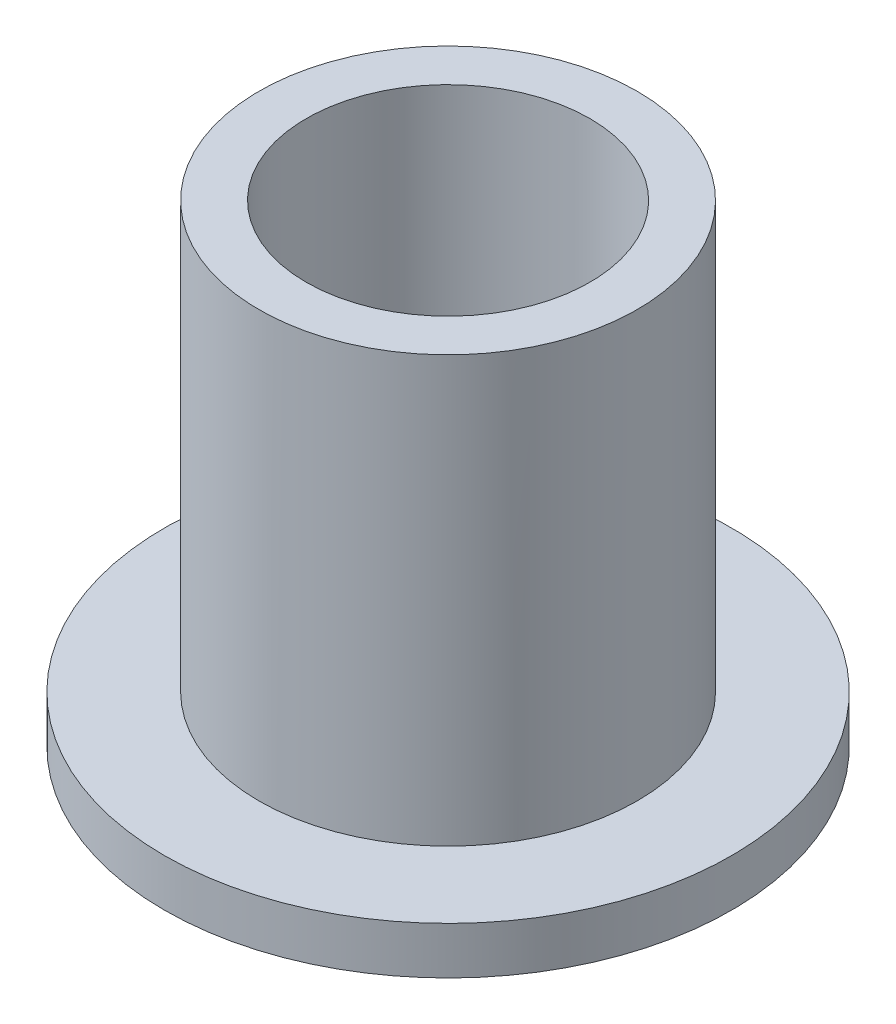
ISO-10303-21;
HEADER;
FILE_DESCRIPTION(('STEP AP214'),'2;1');
FILE_NAME('part.step','',(''),(''),'','','');
FILE_SCHEMA(('AUTOMOTIVE_DESIGN { 1 0 10303 214 1 1 1 1 }'));
ENDSEC;
DATA;
#1=APPLICATION_CONTEXT('core data for automotive mechanical design processes');
#2=APPLICATION_PROTOCOL_DEFINITION('international standard','automotive_design',2000,#1);
#3=PRODUCT_CONTEXT('',#1,'mechanical');
#4=PRODUCT('Part','Part','',(#3));
#5=PRODUCT_RELATED_PRODUCT_CATEGORY('part','',(#4));
#6=PRODUCT_DEFINITION_FORMATION('','',#4);
#7=PRODUCT_DEFINITION_CONTEXT('part definition',#1,'design');
#8=PRODUCT_DEFINITION('design','',#6,#7);
#9=PRODUCT_DEFINITION_SHAPE('','',#8);
#10=(LENGTH_UNIT() NAMED_UNIT(*) SI_UNIT(.MILLI.,.METRE.));
#11=(NAMED_UNIT(*) PLANE_ANGLE_UNIT() SI_UNIT($,.RADIAN.));
#12=(NAMED_UNIT(*) SI_UNIT($,.STERADIAN.) SOLID_ANGLE_UNIT());
#13=UNCERTAINTY_MEASURE_WITH_UNIT(LENGTH_MEASURE(1.E-05),#10,'distance_accuracy_value','');
#14=(GEOMETRIC_REPRESENTATION_CONTEXT(3) GLOBAL_UNCERTAINTY_ASSIGNED_CONTEXT((#13)) GLOBAL_UNIT_ASSIGNED_CONTEXT((#10,
#11,#12)) REPRESENTATION_CONTEXT('',''));
#15=CARTESIAN_POINT('',(0.,0.,0.));
#16=DIRECTION('',(0.,0.,1.));
#17=DIRECTION('',(1.,0.,0.));
#18=AXIS2_PLACEMENT_3D('',#15,#16,#17);
#19=CARTESIAN_POINT('',(0.,10.,-3.));
#20=DIRECTION('',(0.,1.,0.));
#21=DIRECTION('',(0.,0.,1.));
#22=AXIS2_PLACEMENT_3D('',#19,#20,#21);
#23=PLANE('',#22);
#24=CARTESIAN_POINT('',(0.,10.,0.));
#25=DIRECTION('',(0.,-1.,0.));
#26=DIRECTION('',(0.,0.,-1.));
#27=AXIS2_PLACEMENT_3D('',#24,#25,#26);
#28=CIRCLE('',#27,3.);
#29=CARTESIAN_POINT('',(0.,10.,-3.));
#30=VERTEX_POINT('',#29);
#31=EDGE_CURVE('E55',#30,#30,#28,.T.);
#32=ORIENTED_EDGE('',*,*,#31,.T.);
#33=EDGE_LOOP('',(#32));
#34=FACE_BOUND('',#33,.T.);
#35=CARTESIAN_POINT('',(0.,10.,0.));
#36=DIRECTION('',(0.,-1.,0.));
#37=DIRECTION('',(0.,0.,-1.));
#38=AXIS2_PLACEMENT_3D('',#35,#36,#37);
#39=CIRCLE('',#38,4.);
#40=CARTESIAN_POINT('',(0.,10.,-4.));
#41=VERTEX_POINT('',#40);
#42=EDGE_CURVE('E43',#41,#41,#39,.T.);
#43=ORIENTED_EDGE('',*,*,#42,.F.);
#44=EDGE_LOOP('',(#43));
#45=FACE_BOUND('',#44,.T.);
#46=ADVANCED_FACE('F36',(#34,#45),#23,.T.);
#47=CARTESIAN_POINT('',(0.,0.,0.));
#48=DIRECTION('',(0.,-1.,0.));
#49=DIRECTION('',(0.,0.,-1.));
#50=AXIS2_PLACEMENT_3D('',#47,#48,#49);
#51=CYLINDRICAL_SURFACE('',#50,4.);
#52=CARTESIAN_POINT('',(0.,1.,0.));
#53=DIRECTION('',(0.,1.,0.));
#54=DIRECTION('',(0.,0.,1.));
#55=AXIS2_PLACEMENT_3D('',#52,#53,#54);
#56=CIRCLE('',#55,4.);
#57=CARTESIAN_POINT('',(0.,1.,4.));
#58=VERTEX_POINT('',#57);
#59=EDGE_CURVE('E10',#58,#58,#56,.F.);
#60=ORIENTED_EDGE('',*,*,#59,.F.);
#61=EDGE_LOOP('',(#60));
#62=FACE_BOUND('',#61,.T.);
#63=ORIENTED_EDGE('',*,*,#42,.T.);
#64=EDGE_LOOP('',(#63));
#65=FACE_BOUND('',#64,.T.);
#66=ADVANCED_FACE('F79',(#62,#65),#51,.T.);
#67=CARTESIAN_POINT('',(0.,0.,-4.));
#68=DIRECTION('',(0.,-1.,0.));
#69=DIRECTION('',(0.,0.,-1.));
#70=AXIS2_PLACEMENT_3D('',#67,#68,#69);
#71=PLANE('',#70);
#72=CARTESIAN_POINT('',(0.,0.,0.));
#73=DIRECTION('',(0.,-1.,0.));
#74=DIRECTION('',(0.,0.,-1.));
#75=AXIS2_PLACEMENT_3D('',#72,#73,#74);
#76=CIRCLE('',#75,3.);
#77=CARTESIAN_POINT('',(0.,0.,-3.));
#78=VERTEX_POINT('',#77);
#79=EDGE_CURVE('E50',#78,#78,#76,.T.);
#80=ORIENTED_EDGE('',*,*,#79,.F.);
#81=EDGE_LOOP('',(#80));
#82=FACE_BOUND('',#81,.T.);
#83=CARTESIAN_POINT('',(0.,0.,0.));
#84=DIRECTION('',(0.,1.,0.));
#85=DIRECTION('',(0.,0.,1.));
#86=AXIS2_PLACEMENT_3D('',#83,#84,#85);
#87=CIRCLE('',#86,6.);
#88=CARTESIAN_POINT('',(0.,0.,6.));
#89=VERTEX_POINT('',#88);
#90=EDGE_CURVE('E61',#89,#89,#87,.T.);
#91=ORIENTED_EDGE('',*,*,#90,.F.);
#92=EDGE_LOOP('',(#91));
#93=FACE_BOUND('',#92,.T.);
#94=ADVANCED_FACE('F76',(#82,#93),#71,.T.);
#95=CARTESIAN_POINT('',(0.,0.,0.));
#96=DIRECTION('',(0.,-1.,0.));
#97=DIRECTION('',(0.,0.,-1.));
#98=AXIS2_PLACEMENT_3D('',#95,#96,#97);
#99=CYLINDRICAL_SURFACE('',#98,3.);
#100=ORIENTED_EDGE('',*,*,#79,.T.);
#101=EDGE_LOOP('',(#100));
#102=FACE_BOUND('',#101,.T.);
#103=ORIENTED_EDGE('',*,*,#31,.F.);
#104=EDGE_LOOP('',(#103));
#105=FACE_BOUND('',#104,.T.);
#106=ADVANCED_FACE('F78',(#102,#105),#99,.F.);
#107=CARTESIAN_POINT('',(0.,1.,0.));
#108=DIRECTION('',(0.,1.,0.));
#109=DIRECTION('',(0.,0.,1.));
#110=AXIS2_PLACEMENT_3D('',#107,#108,#109);
#111=PLANE('',#110);
#112=CARTESIAN_POINT('',(0.,1.,0.));
#113=DIRECTION('',(0.,1.,0.));
#114=DIRECTION('',(0.,0.,1.));
#115=AXIS2_PLACEMENT_3D('',#112,#113,#114);
#116=CIRCLE('',#115,6.);
#117=CARTESIAN_POINT('',(0.,1.,6.));
#118=VERTEX_POINT('',#117);
#119=EDGE_CURVE('E60',#118,#118,#116,.T.);
#120=ORIENTED_EDGE('',*,*,#119,.T.);
#121=EDGE_LOOP('',(#120));
#122=FACE_BOUND('',#121,.T.);
#123=ORIENTED_EDGE('',*,*,#59,.T.);
#124=EDGE_LOOP('',(#123));
#125=FACE_BOUND('',#124,.T.);
#126=ADVANCED_FACE('F68',(#122,#125),#111,.T.);
#127=CARTESIAN_POINT('',(0.,1.,0.));
#128=DIRECTION('',(0.,-1.,0.));
#129=DIRECTION('',(0.,0.,-1.));
#130=AXIS2_PLACEMENT_3D('',#127,#128,#129);
#131=CYLINDRICAL_SURFACE('',#130,6.);
#132=ORIENTED_EDGE('',*,*,#119,.F.);
#133=EDGE_LOOP('',(#132));
#134=FACE_BOUND('',#133,.T.);
#135=ORIENTED_EDGE('',*,*,#90,.T.);
#136=EDGE_LOOP('',(#135));
#137=FACE_BOUND('',#136,.T.);
#138=ADVANCED_FACE('F70',(#134,#137),#131,.T.);
#139=CLOSED_SHELL('',(#46,#66,#94,#106,#126,#138));
#140=MANIFOLD_SOLID_BREP('B2',#139);
#141=ADVANCED_BREP_SHAPE_REPRESENTATION('',(#18,#140),#14);
#142=SHAPE_DEFINITION_REPRESENTATION(#9,#141);
ENDSEC;
END-ISO-10303-21;
